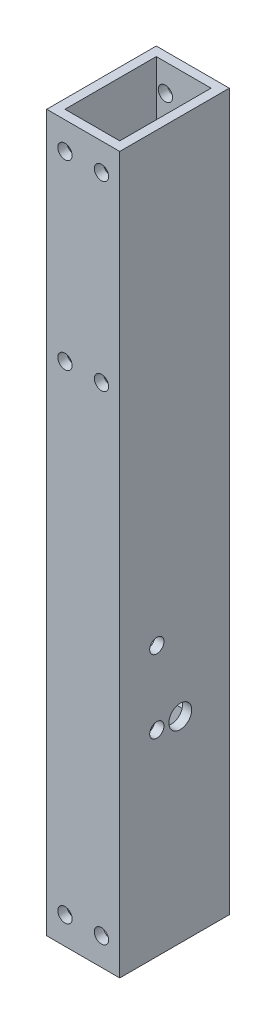
ISO-10303-21;
HEADER;
FILE_DESCRIPTION(('STEP AP214'),'2;1');
FILE_NAME('part.step','',(''),(''),'','','');
FILE_SCHEMA(('AUTOMOTIVE_DESIGN { 1 0 10303 214 1 1 1 1 }'));
ENDSEC;
DATA;
#1=APPLICATION_CONTEXT('core data for automotive mechanical design processes');
#2=APPLICATION_PROTOCOL_DEFINITION('international standard','automotive_design',2000,#1);
#3=PRODUCT_CONTEXT('',#1,'mechanical');
#4=PRODUCT('Part','Part','',(#3));
#5=PRODUCT_RELATED_PRODUCT_CATEGORY('part','',(#4));
#6=PRODUCT_DEFINITION_FORMATION('','',#4);
#7=PRODUCT_DEFINITION_CONTEXT('part definition',#1,'design');
#8=PRODUCT_DEFINITION('design','',#6,#7);
#9=PRODUCT_DEFINITION_SHAPE('','',#8);
#10=(LENGTH_UNIT() NAMED_UNIT(*) SI_UNIT(.MILLI.,.METRE.));
#11=(NAMED_UNIT(*) PLANE_ANGLE_UNIT() SI_UNIT($,.RADIAN.));
#12=(NAMED_UNIT(*) SI_UNIT($,.STERADIAN.) SOLID_ANGLE_UNIT());
#13=UNCERTAINTY_MEASURE_WITH_UNIT(LENGTH_MEASURE(1.E-05),#10,'distance_accuracy_value','');
#14=(GEOMETRIC_REPRESENTATION_CONTEXT(3) GLOBAL_UNCERTAINTY_ASSIGNED_CONTEXT((#13)) GLOBAL_UNIT_ASSIGNED_CONTEXT((#10,
#11,#12)) REPRESENTATION_CONTEXT('',''));
#15=CARTESIAN_POINT('',(0.,0.,0.));
#16=DIRECTION('',(0.,0.,1.));
#17=DIRECTION('',(1.,0.,0.));
#18=AXIS2_PLACEMENT_3D('',#15,#16,#17);
#19=CARTESIAN_POINT('',(21.082,57.1499999999999,-17.9470819172588));
#20=DIRECTION('',(0.,0.,1.));
#21=DIRECTION('',(1.,0.,0.));
#22=AXIS2_PLACEMENT_3D('',#19,#20,#21);
#23=PLANE('',#22);
#24=DIRECTION('',(0.,1.,0.));
#25=VECTOR('',#24,1.);
#26=CARTESIAN_POINT('',(0.,57.1499999999999,-17.9470819172588));
#27=LINE('',#26,#25);
#28=CARTESIAN_POINT('',(0.,57.1499999999999,-17.9470819172588));
#29=VERTEX_POINT('',#28);
#30=CARTESIAN_POINT('',(0.,65.8065865135179,-17.9470819172588));
#31=VERTEX_POINT('',#30);
#32=EDGE_CURVE('E181',#29,#31,#27,.T.);
#33=ORIENTED_EDGE('',*,*,#32,.T.);
#34=DIRECTION('',(1.,0.,0.));
#35=VECTOR('',#34,1.);
#36=CARTESIAN_POINT('',(0.,65.8065865135179,-17.9470819172588));
#37=LINE('',#36,#35);
#38=CARTESIAN_POINT('',(3.175,65.8065865135179,-17.9470819172588));
#39=VERTEX_POINT('',#38);
#40=EDGE_CURVE('E12',#31,#39,#37,.T.);
#41=ORIENTED_EDGE('',*,*,#40,.T.);
#42=DIRECTION('',(0.,-1.,0.));
#43=VECTOR('',#42,1.);
#44=CARTESIAN_POINT('',(3.175,248.92,-17.9470819172588));
#45=LINE('',#44,#43);
#46=CARTESIAN_POINT('',(3.175,57.1499999999999,-17.9470819172588));
#47=VERTEX_POINT('',#46);
#48=EDGE_CURVE('E287',#39,#47,#45,.T.);
#49=ORIENTED_EDGE('',*,*,#48,.T.);
#50=DIRECTION('',(-1.,0.,0.));
#51=VECTOR('',#50,1.);
#52=CARTESIAN_POINT('',(21.082,57.1499999999999,-17.9470819172588));
#53=LINE('',#52,#51);
#54=EDGE_CURVE('E187',#47,#29,#53,.T.);
#55=ORIENTED_EDGE('',*,*,#54,.T.);
#56=EDGE_LOOP('',(#33,#41,#49,#55));
#57=FACE_BOUND('',#56,.T.);
#58=ADVANCED_FACE('F59',(#57),#23,.F.);
#59=CARTESIAN_POINT('',(0.,248.92,0.));
#60=DIRECTION('',(0.,1.,0.));
#61=DIRECTION('',(0.,0.,1.));
#62=AXIS2_PLACEMENT_3D('',#59,#60,#61);
#63=PLANE('',#62);
#64=DIRECTION('',(0.,0.,1.));
#65=VECTOR('',#64,1.);
#66=CARTESIAN_POINT('',(0.,248.92,0.));
#67=LINE('',#66,#65);
#68=CARTESIAN_POINT('',(0.,248.92,-38.1));
#69=VERTEX_POINT('',#68);
#70=CARTESIAN_POINT('',(0.,248.92,0.));
#71=VERTEX_POINT('',#70);
#72=EDGE_CURVE('E248',#69,#71,#67,.T.);
#73=ORIENTED_EDGE('',*,*,#72,.T.);
#74=DIRECTION('',(1.,0.,0.));
#75=VECTOR('',#74,1.);
#76=CARTESIAN_POINT('',(0.,248.92,0.));
#77=LINE('',#76,#75);
#78=CARTESIAN_POINT('',(25.4,248.92,0.));
#79=VERTEX_POINT('',#78);
#80=EDGE_CURVE('E251',#71,#79,#77,.T.);
#81=ORIENTED_EDGE('',*,*,#80,.T.);
#82=DIRECTION('',(0.,0.,-1.));
#83=VECTOR('',#82,1.);
#84=CARTESIAN_POINT('',(25.4,248.92,0.));
#85=LINE('',#84,#83);
#86=CARTESIAN_POINT('',(25.4,248.92,-38.1));
#87=VERTEX_POINT('',#86);
#88=EDGE_CURVE('E254',#79,#87,#85,.T.);
#89=ORIENTED_EDGE('',*,*,#88,.T.);
#90=DIRECTION('',(-1.,0.,0.));
#91=VECTOR('',#90,1.);
#92=CARTESIAN_POINT('',(0.,248.92,-38.1));
#93=LINE('',#92,#91);
#94=EDGE_CURVE('E256',#87,#69,#93,.T.);
#95=ORIENTED_EDGE('',*,*,#94,.T.);
#96=EDGE_LOOP('',(#73,#81,#89,#95));
#97=FACE_BOUND('',#96,.T.);
#98=DIRECTION('',(1.,0.,0.));
#99=VECTOR('',#98,1.);
#100=CARTESIAN_POINT('',(0.,248.92,-3.175));
#101=LINE('',#100,#99);
#102=CARTESIAN_POINT('',(3.175,248.92,-3.175));
#103=VERTEX_POINT('',#102);
#104=CARTESIAN_POINT('',(22.225,248.92,-3.175));
#105=VERTEX_POINT('',#104);
#106=EDGE_CURVE('E218',#103,#105,#101,.T.);
#107=ORIENTED_EDGE('',*,*,#106,.F.);
#108=DIRECTION('',(0.,0.,1.));
#109=VECTOR('',#108,1.);
#110=CARTESIAN_POINT('',(3.175,248.92,0.));
#111=LINE('',#110,#109);
#112=CARTESIAN_POINT('',(3.175,248.92,-34.925));
#113=VERTEX_POINT('',#112);
#114=EDGE_CURVE('E216',#113,#103,#111,.T.);
#115=ORIENTED_EDGE('',*,*,#114,.F.);
#116=DIRECTION('',(-1.,0.,0.));
#117=VECTOR('',#116,1.);
#118=CARTESIAN_POINT('',(0.,248.92,-34.925));
#119=LINE('',#118,#117);
#120=CARTESIAN_POINT('',(22.225,248.92,-34.925));
#121=VERTEX_POINT('',#120);
#122=EDGE_CURVE('E224',#121,#113,#119,.T.);
#123=ORIENTED_EDGE('',*,*,#122,.F.);
#124=DIRECTION('',(0.,0.,-1.));
#125=VECTOR('',#124,1.);
#126=CARTESIAN_POINT('',(22.225,248.92,0.));
#127=LINE('',#126,#125);
#128=EDGE_CURVE('E221',#105,#121,#127,.T.);
#129=ORIENTED_EDGE('',*,*,#128,.F.);
#130=EDGE_LOOP('',(#107,#115,#123,#129));
#131=FACE_BOUND('',#130,.T.);
#132=ADVANCED_FACE('F434',(#97,#131),#63,.T.);
#133=CARTESIAN_POINT('',(0.,0.,0.));
#134=DIRECTION('',(0.,1.,0.));
#135=DIRECTION('',(0.,0.,1.));
#136=AXIS2_PLACEMENT_3D('',#133,#134,#135);
#137=PLANE('',#136);
#138=DIRECTION('',(0.,0.,1.));
#139=VECTOR('',#138,1.);
#140=CARTESIAN_POINT('',(0.,0.,0.));
#141=LINE('',#140,#139);
#142=CARTESIAN_POINT('',(0.,0.,-38.1));
#143=VERTEX_POINT('',#142);
#144=CARTESIAN_POINT('',(0.,0.,0.));
#145=VERTEX_POINT('',#144);
#146=EDGE_CURVE('E247',#143,#145,#141,.T.);
#147=ORIENTED_EDGE('',*,*,#146,.F.);
#148=DIRECTION('',(-1.,0.,0.));
#149=VECTOR('',#148,1.);
#150=CARTESIAN_POINT('',(0.,0.,-38.1));
#151=LINE('',#150,#149);
#152=CARTESIAN_POINT('',(25.4,0.,-38.1));
#153=VERTEX_POINT('',#152);
#154=EDGE_CURVE('E252',#153,#143,#151,.T.);
#155=ORIENTED_EDGE('',*,*,#154,.F.);
#156=DIRECTION('',(0.,0.,-1.));
#157=VECTOR('',#156,1.);
#158=CARTESIAN_POINT('',(25.4,0.,0.));
#159=LINE('',#158,#157);
#160=CARTESIAN_POINT('',(25.4,0.,0.));
#161=VERTEX_POINT('',#160);
#162=EDGE_CURVE('E263',#161,#153,#159,.T.);
#163=ORIENTED_EDGE('',*,*,#162,.F.);
#164=DIRECTION('',(1.,0.,0.));
#165=VECTOR('',#164,1.);
#166=CARTESIAN_POINT('',(0.,0.,0.));
#167=LINE('',#166,#165);
#168=EDGE_CURVE('E261',#145,#161,#167,.T.);
#169=ORIENTED_EDGE('',*,*,#168,.F.);
#170=EDGE_LOOP('',(#147,#155,#163,#169));
#171=FACE_BOUND('',#170,.T.);
#172=DIRECTION('',(0.,0.,1.));
#173=VECTOR('',#172,1.);
#174=CARTESIAN_POINT('',(3.175,0.,0.));
#175=LINE('',#174,#173);
#176=CARTESIAN_POINT('',(3.175,0.,-34.925));
#177=VERTEX_POINT('',#176);
#178=CARTESIAN_POINT('',(3.175,0.,-3.175));
#179=VERTEX_POINT('',#178);
#180=EDGE_CURVE('E215',#177,#179,#175,.T.);
#181=ORIENTED_EDGE('',*,*,#180,.T.);
#182=DIRECTION('',(1.,0.,0.));
#183=VECTOR('',#182,1.);
#184=CARTESIAN_POINT('',(0.,0.,-3.175));
#185=LINE('',#184,#183);
#186=CARTESIAN_POINT('',(22.225,0.,-3.175));
#187=VERTEX_POINT('',#186);
#188=EDGE_CURVE('E229',#179,#187,#185,.T.);
#189=ORIENTED_EDGE('',*,*,#188,.T.);
#190=DIRECTION('',(0.,0.,-1.));
#191=VECTOR('',#190,1.);
#192=CARTESIAN_POINT('',(22.225,0.,0.));
#193=LINE('',#192,#191);
#194=CARTESIAN_POINT('',(22.225,0.,-34.925));
#195=VERTEX_POINT('',#194);
#196=EDGE_CURVE('E232',#187,#195,#193,.T.);
#197=ORIENTED_EDGE('',*,*,#196,.T.);
#198=DIRECTION('',(-1.,0.,0.));
#199=VECTOR('',#198,1.);
#200=CARTESIAN_POINT('',(0.,0.,-34.925));
#201=LINE('',#200,#199);
#202=EDGE_CURVE('E219',#195,#177,#201,.T.);
#203=ORIENTED_EDGE('',*,*,#202,.T.);
#204=EDGE_LOOP('',(#181,#189,#197,#203));
#205=FACE_BOUND('',#204,.T.);
#206=ADVANCED_FACE('F427',(#171,#205),#137,.F.);
#207=CARTESIAN_POINT('',(0.,248.92,0.));
#208=DIRECTION('',(1.,0.,0.));
#209=DIRECTION('',(0.,0.,-1.));
#210=AXIS2_PLACEMENT_3D('',#207,#208,#209);
#211=PLANE('',#210);
#212=CARTESIAN_POINT('',(0.,68.2624999999999,-12.9032000000046));
#213=DIRECTION('',(-1.,0.,0.));
#214=DIRECTION('',(0.,0.,1.));
#215=AXIS2_PLACEMENT_3D('',#212,#213,#214);
#216=CIRCLE('',#215,2.4892);
#217=CARTESIAN_POINT('',(0.,68.2624999999999,-10.4140000000046));
#218=VERTEX_POINT('',#217);
#219=EDGE_CURVE('E377',#218,#218,#216,.T.);
#220=ORIENTED_EDGE('',*,*,#219,.F.);
#221=EDGE_LOOP('',(#220));
#222=FACE_BOUND('',#221,.T.);
#223=CARTESIAN_POINT('',(0.,93.6624999999999,-12.903200000003));
#224=DIRECTION('',(-1.,0.,0.));
#225=DIRECTION('',(0.,0.,1.));
#226=AXIS2_PLACEMENT_3D('',#223,#224,#225);
#227=CIRCLE('',#226,2.48919999999999);
#228=CARTESIAN_POINT('',(0.,93.6624999999999,-10.414000000003));
#229=VERTEX_POINT('',#228);
#230=EDGE_CURVE('E386',#229,#229,#227,.T.);
#231=ORIENTED_EDGE('',*,*,#230,.F.);
#232=EDGE_LOOP('',(#231));
#233=FACE_BOUND('',#232,.T.);
#234=CARTESIAN_POINT('',(0.,70.7184134864701,-17.9470819172588));
#235=VERTEX_POINT('',#234);
#236=CARTESIAN_POINT('',(0.,79.375,-17.9470819172588));
#237=VERTEX_POINT('',#236);
#238=EDGE_CURVE('E183',#235,#237,#27,.T.);
#239=ORIENTED_EDGE('',*,*,#238,.F.);
#240=CARTESIAN_POINT('',(0.,68.262499999994,-21.0566000000072));
#241=DIRECTION('',(1.,0.,0.));
#242=DIRECTION('',(0.,1.,0.));
#243=AXIS2_PLACEMENT_3D('',#240,#241,#242);
#244=CIRCLE('',#243,3.9623999999993);
#245=EDGE_CURVE('E76',#235,#31,#244,.T.);
#246=ORIENTED_EDGE('',*,*,#245,.T.);
#247=ORIENTED_EDGE('',*,*,#32,.F.);
#248=DIRECTION('',(0.,0.,1.));
#249=VECTOR('',#248,1.);
#250=CARTESIAN_POINT('',(0.,57.1499999999999,-17.9470819172588));
#251=LINE('',#250,#249);
#252=CARTESIAN_POINT('',(0.,57.1499999999999,-38.1));
#253=VERTEX_POINT('',#252);
#254=EDGE_CURVE('E191',#253,#29,#251,.T.);
#255=ORIENTED_EDGE('',*,*,#254,.F.);
#256=DIRECTION('',(0.,-1.,0.));
#257=VECTOR('',#256,1.);
#258=CARTESIAN_POINT('',(0.,248.92,-38.1));
#259=LINE('',#258,#257);
#260=EDGE_CURVE('E258',#253,#143,#259,.T.);
#261=ORIENTED_EDGE('',*,*,#260,.T.);
#262=ORIENTED_EDGE('',*,*,#146,.T.);
#263=DIRECTION('',(0.,-1.,0.));
#264=VECTOR('',#263,1.);
#265=CARTESIAN_POINT('',(0.,248.92,0.));
#266=LINE('',#265,#264);
#267=EDGE_CURVE('E276',#71,#145,#266,.T.);
#268=ORIENTED_EDGE('',*,*,#267,.F.);
#269=ORIENTED_EDGE('',*,*,#72,.F.);
#270=CARTESIAN_POINT('',(0.,79.375,-38.1));
#271=VERTEX_POINT('',#270);
#272=EDGE_CURVE('E267',#69,#271,#259,.T.);
#273=ORIENTED_EDGE('',*,*,#272,.T.);
#274=DIRECTION('',(0.,0.,-1.));
#275=VECTOR('',#274,1.);
#276=CARTESIAN_POINT('',(0.,79.375,-17.9470819172588));
#277=LINE('',#276,#275);
#278=EDGE_CURVE('E189',#237,#271,#277,.T.);
#279=ORIENTED_EDGE('',*,*,#278,.F.);
#280=EDGE_LOOP('',(#239,#246,#247,#255,#261,#262,#268,#269,#273,#279));
#281=FACE_BOUND('',#280,.T.);
#282=ADVANCED_FACE('F61',(#222,#233,#281),#211,.F.);
#283=CARTESIAN_POINT('',(0.,248.92,0.));
#284=DIRECTION('',(0.,0.,-1.));
#285=DIRECTION('',(-1.,0.,0.));
#286=AXIS2_PLACEMENT_3D('',#283,#284,#285);
#287=PLANE('',#286);
#288=CARTESIAN_POINT('',(19.0500000000001,176.154649999993,0.));
#289=DIRECTION('',(0.,0.,-1.));
#290=DIRECTION('',(-1.,0.,0.));
#291=AXIS2_PLACEMENT_3D('',#288,#289,#290);
#292=CIRCLE('',#291,2.48920000000288);
#293=CARTESIAN_POINT('',(16.5607999999972,176.154649999993,0.));
#294=VERTEX_POINT('',#293);
#295=EDGE_CURVE('E319',#294,#294,#292,.T.);
#296=ORIENTED_EDGE('',*,*,#295,.T.);
#297=EDGE_LOOP('',(#296));
#298=FACE_BOUND('',#297,.T.);
#299=CARTESIAN_POINT('',(6.35000000000008,176.154649999993,0.));
#300=DIRECTION('',(0.,0.,-1.));
#301=DIRECTION('',(-1.,0.,0.));
#302=AXIS2_PLACEMENT_3D('',#299,#300,#301);
#303=CIRCLE('',#302,2.48920000000288);
#304=CARTESIAN_POINT('',(3.86079999999719,176.154649999993,0.));
#305=VERTEX_POINT('',#304);
#306=EDGE_CURVE('E330',#305,#305,#303,.T.);
#307=ORIENTED_EDGE('',*,*,#306,.T.);
#308=EDGE_LOOP('',(#307));
#309=FACE_BOUND('',#308,.T.);
#310=CARTESIAN_POINT('',(19.05,239.395,0.));
#311=DIRECTION('',(0.,0.,-1.));
#312=DIRECTION('',(-1.,0.,0.));
#313=AXIS2_PLACEMENT_3D('',#310,#311,#312);
#314=CIRCLE('',#313,2.48920000000013);
#315=CARTESIAN_POINT('',(16.5607999999999,239.395,0.));
#316=VERTEX_POINT('',#315);
#317=EDGE_CURVE('E355',#316,#316,#314,.T.);
#318=ORIENTED_EDGE('',*,*,#317,.T.);
#319=EDGE_LOOP('',(#318));
#320=FACE_BOUND('',#319,.T.);
#321=CARTESIAN_POINT('',(6.34999999999999,239.395,0.));
#322=DIRECTION('',(0.,0.,-1.));
#323=DIRECTION('',(-1.,0.,0.));
#324=AXIS2_PLACEMENT_3D('',#321,#322,#323);
#325=CIRCLE('',#324,2.48920000000011);
#326=CARTESIAN_POINT('',(3.86079999999989,239.395,0.));
#327=VERTEX_POINT('',#326);
#328=EDGE_CURVE('E349',#327,#327,#325,.T.);
#329=ORIENTED_EDGE('',*,*,#328,.T.);
#330=EDGE_LOOP('',(#329));
#331=FACE_BOUND('',#330,.T.);
#332=CARTESIAN_POINT('',(6.35000000000032,9.52500000000017,0.));
#333=DIRECTION('',(0.,0.,-1.));
#334=DIRECTION('',(-1.,0.,0.));
#335=AXIS2_PLACEMENT_3D('',#332,#333,#334);
#336=CIRCLE('',#335,2.4892);
#337=CARTESIAN_POINT('',(3.86080000000032,9.52500000000017,0.));
#338=VERTEX_POINT('',#337);
#339=EDGE_CURVE('E342',#338,#338,#336,.T.);
#340=ORIENTED_EDGE('',*,*,#339,.T.);
#341=EDGE_LOOP('',(#340));
#342=FACE_BOUND('',#341,.T.);
#343=CARTESIAN_POINT('',(19.0500000000003,9.52500000000002,0.));
#344=DIRECTION('',(0.,0.,-1.));
#345=DIRECTION('',(-1.,0.,0.));
#346=AXIS2_PLACEMENT_3D('',#343,#344,#345);
#347=CIRCLE('',#346,2.4892);
#348=CARTESIAN_POINT('',(16.5608000000003,9.52500000000002,0.));
#349=VERTEX_POINT('',#348);
#350=EDGE_CURVE('E305',#349,#349,#347,.T.);
#351=ORIENTED_EDGE('',*,*,#350,.T.);
#352=EDGE_LOOP('',(#351));
#353=FACE_BOUND('',#352,.T.);
#354=ORIENTED_EDGE('',*,*,#168,.T.);
#355=DIRECTION('',(0.,-1.,0.));
#356=VECTOR('',#355,1.);
#357=CARTESIAN_POINT('',(25.4,248.92,0.));
#358=LINE('',#357,#356);
#359=EDGE_CURVE('E273',#79,#161,#358,.T.);
#360=ORIENTED_EDGE('',*,*,#359,.F.);
#361=ORIENTED_EDGE('',*,*,#80,.F.);
#362=ORIENTED_EDGE('',*,*,#267,.T.);
#363=EDGE_LOOP('',(#354,#360,#361,#362));
#364=FACE_BOUND('',#363,.T.);
#365=ADVANCED_FACE('F431',(#298,#309,#320,#331,#342,#353,#364),#287,.F.);
#366=CARTESIAN_POINT('',(25.4,248.92,0.));
#367=DIRECTION('',(-1.,0.,0.));
#368=DIRECTION('',(0.,0.,1.));
#369=AXIS2_PLACEMENT_3D('',#366,#367,#368);
#370=PLANE('',#369);
#371=CARTESIAN_POINT('',(25.4,68.262499999994,-21.056600000008));
#372=DIRECTION('',(1.,0.,0.));
#373=DIRECTION('',(0.,0.,-1.));
#374=AXIS2_PLACEMENT_3D('',#371,#372,#373);
#375=CIRCLE('',#374,3.96239999999845);
#376=CARTESIAN_POINT('',(25.4,68.262499999994,-25.0190000000065));
#377=VERTEX_POINT('',#376);
#378=EDGE_CURVE('E373',#377,#377,#375,.T.);
#379=ORIENTED_EDGE('',*,*,#378,.F.);
#380=EDGE_LOOP('',(#379));
#381=FACE_BOUND('',#380,.T.);
#382=CARTESIAN_POINT('',(25.4,68.2624999999999,-12.9032000000046));
#383=DIRECTION('',(-1.,0.,0.));
#384=DIRECTION('',(0.,0.,1.));
#385=AXIS2_PLACEMENT_3D('',#382,#383,#384);
#386=CIRCLE('',#385,2.4892);
#387=CARTESIAN_POINT('',(25.4,68.2624999999999,-10.4140000000046));
#388=VERTEX_POINT('',#387);
#389=EDGE_CURVE('E299',#388,#388,#386,.T.);
#390=ORIENTED_EDGE('',*,*,#389,.T.);
#391=EDGE_LOOP('',(#390));
#392=FACE_BOUND('',#391,.T.);
#393=CARTESIAN_POINT('',(25.4,93.6624999999999,-12.903200000003));
#394=DIRECTION('',(-1.,0.,0.));
#395=DIRECTION('',(0.,0.,1.));
#396=AXIS2_PLACEMENT_3D('',#393,#394,#395);
#397=CIRCLE('',#396,2.48919999999999);
#398=CARTESIAN_POINT('',(25.4,93.6624999999999,-10.414000000003));
#399=VERTEX_POINT('',#398);
#400=EDGE_CURVE('E294',#399,#399,#397,.T.);
#401=ORIENTED_EDGE('',*,*,#400,.T.);
#402=EDGE_LOOP('',(#401));
#403=FACE_BOUND('',#402,.T.);
#404=ORIENTED_EDGE('',*,*,#162,.T.);
#405=DIRECTION('',(0.,-1.,0.));
#406=VECTOR('',#405,1.);
#407=CARTESIAN_POINT('',(25.4,248.92,-38.1));
#408=LINE('',#407,#406);
#409=EDGE_CURVE('E270',#87,#153,#408,.T.);
#410=ORIENTED_EDGE('',*,*,#409,.F.);
#411=ORIENTED_EDGE('',*,*,#88,.F.);
#412=ORIENTED_EDGE('',*,*,#359,.T.);
#413=EDGE_LOOP('',(#404,#410,#411,#412));
#414=FACE_BOUND('',#413,.T.);
#415=ADVANCED_FACE('F437',(#381,#392,#403,#414),#370,.F.);
#416=CARTESIAN_POINT('',(0.,248.92,-38.1));
#417=DIRECTION('',(0.,0.,1.));
#418=DIRECTION('',(1.,0.,0.));
#419=AXIS2_PLACEMENT_3D('',#416,#417,#418);
#420=PLANE('',#419);
#421=CARTESIAN_POINT('',(19.0500000000001,176.154649999993,-38.1));
#422=DIRECTION('',(0.,0.,-1.));
#423=DIRECTION('',(-1.,0.,0.));
#424=AXIS2_PLACEMENT_3D('',#421,#422,#423);
#425=CIRCLE('',#424,2.48920000000288);
#426=CARTESIAN_POINT('',(16.5607999999972,176.154649999993,-38.1));
#427=VERTEX_POINT('',#426);
#428=EDGE_CURVE('E325',#427,#427,#425,.T.);
#429=ORIENTED_EDGE('',*,*,#428,.F.);
#430=EDGE_LOOP('',(#429));
#431=FACE_BOUND('',#430,.T.);
#432=CARTESIAN_POINT('',(6.35000000000008,176.154649999993,-38.1));
#433=DIRECTION('',(0.,0.,-1.));
#434=DIRECTION('',(-1.,0.,0.));
#435=AXIS2_PLACEMENT_3D('',#432,#433,#434);
#436=CIRCLE('',#435,2.48920000000288);
#437=CARTESIAN_POINT('',(3.86079999999719,176.154649999993,-38.1));
#438=VERTEX_POINT('',#437);
#439=EDGE_CURVE('E335',#438,#438,#436,.T.);
#440=ORIENTED_EDGE('',*,*,#439,.F.);
#441=EDGE_LOOP('',(#440));
#442=FACE_BOUND('',#441,.T.);
#443=CARTESIAN_POINT('',(19.05,239.395,-38.1));
#444=DIRECTION('',(0.,0.,-1.));
#445=DIRECTION('',(-1.,0.,0.));
#446=AXIS2_PLACEMENT_3D('',#443,#444,#445);
#447=CIRCLE('',#446,2.48920000000013);
#448=CARTESIAN_POINT('',(16.5607999999999,239.395,-38.1));
#449=VERTEX_POINT('',#448);
#450=EDGE_CURVE('E341',#449,#449,#447,.T.);
#451=ORIENTED_EDGE('',*,*,#450,.F.);
#452=EDGE_LOOP('',(#451));
#453=FACE_BOUND('',#452,.T.);
#454=CARTESIAN_POINT('',(6.34999999999999,239.395,-38.1));
#455=DIRECTION('',(0.,0.,-1.));
#456=DIRECTION('',(-1.,0.,0.));
#457=AXIS2_PLACEMENT_3D('',#454,#455,#456);
#458=CIRCLE('',#457,2.48920000000011);
#459=CARTESIAN_POINT('',(3.86079999999989,239.395,-38.1));
#460=VERTEX_POINT('',#459);
#461=EDGE_CURVE('E352',#460,#460,#458,.T.);
#462=ORIENTED_EDGE('',*,*,#461,.F.);
#463=EDGE_LOOP('',(#462));
#464=FACE_BOUND('',#463,.T.);
#465=CARTESIAN_POINT('',(6.35000000000032,9.52500000000017,-38.1));
#466=DIRECTION('',(0.,0.,-1.));
#467=DIRECTION('',(-1.,0.,0.));
#468=AXIS2_PLACEMENT_3D('',#465,#466,#467);
#469=CIRCLE('',#468,2.4892);
#470=CARTESIAN_POINT('',(3.86080000000032,9.52500000000017,-38.1));
#471=VERTEX_POINT('',#470);
#472=EDGE_CURVE('E346',#471,#471,#469,.T.);
#473=ORIENTED_EDGE('',*,*,#472,.F.);
#474=EDGE_LOOP('',(#473));
#475=FACE_BOUND('',#474,.T.);
#476=CARTESIAN_POINT('',(19.0500000000003,9.52500000000002,-38.1));
#477=DIRECTION('',(0.,0.,-1.));
#478=DIRECTION('',(-1.,0.,0.));
#479=AXIS2_PLACEMENT_3D('',#476,#477,#478);
#480=CIRCLE('',#479,2.4892);
#481=CARTESIAN_POINT('',(16.5608000000003,9.52500000000002,-38.1));
#482=VERTEX_POINT('',#481);
#483=EDGE_CURVE('E345',#482,#482,#480,.T.);
#484=ORIENTED_EDGE('',*,*,#483,.F.);
#485=EDGE_LOOP('',(#484));
#486=FACE_BOUND('',#485,.T.);
#487=ORIENTED_EDGE('',*,*,#260,.F.);
#488=DIRECTION('',(1.,0.,0.));
#489=VECTOR('',#488,1.);
#490=CARTESIAN_POINT('',(0.,57.1499999999999,-38.1));
#491=LINE('',#490,#489);
#492=CARTESIAN_POINT('',(21.082,57.1499999999999,-38.1));
#493=VERTEX_POINT('',#492);
#494=EDGE_CURVE('E212',#253,#493,#491,.T.);
#495=ORIENTED_EDGE('',*,*,#494,.T.);
#496=DIRECTION('',(0.,-1.,0.));
#497=VECTOR('',#496,1.);
#498=CARTESIAN_POINT('',(21.082,248.92,-38.1));
#499=LINE('',#498,#497);
#500=CARTESIAN_POINT('',(21.082,79.375,-38.1));
#501=VERTEX_POINT('',#500);
#502=EDGE_CURVE('E200',#501,#493,#499,.T.);
#503=ORIENTED_EDGE('',*,*,#502,.F.);
#504=DIRECTION('',(-1.,0.,0.));
#505=VECTOR('',#504,1.);
#506=CARTESIAN_POINT('',(0.,79.3749999999999,-38.1));
#507=LINE('',#506,#505);
#508=EDGE_CURVE('E207',#501,#271,#507,.T.);
#509=ORIENTED_EDGE('',*,*,#508,.T.);
#510=ORIENTED_EDGE('',*,*,#272,.F.);
#511=ORIENTED_EDGE('',*,*,#94,.F.);
#512=ORIENTED_EDGE('',*,*,#409,.T.);
#513=ORIENTED_EDGE('',*,*,#154,.T.);
#514=EDGE_LOOP('',(#487,#495,#503,#509,#510,#511,#512,#513));
#515=FACE_BOUND('',#514,.T.);
#516=ADVANCED_FACE('F421',(#431,#442,#453,#464,#475,#486,#515),#420,.F.);
#517=CARTESIAN_POINT('',(3.175,248.92,0.));
#518=DIRECTION('',(1.,0.,0.));
#519=DIRECTION('',(0.,0.,-1.));
#520=AXIS2_PLACEMENT_3D('',#517,#518,#519);
#521=PLANE('',#520);
#522=CARTESIAN_POINT('',(3.175,68.262499999994,-21.0566000000072));
#523=DIRECTION('',(1.,0.,0.));
#524=DIRECTION('',(0.,0.,-1.));
#525=AXIS2_PLACEMENT_3D('',#522,#523,#524);
#526=CIRCLE('',#525,3.9623999999993);
#527=CARTESIAN_POINT('',(3.175,70.7184134864701,-17.9470819172588));
#528=VERTEX_POINT('',#527);
#529=EDGE_CURVE('E173',#528,#39,#526,.T.);
#530=ORIENTED_EDGE('',*,*,#529,.F.);
#531=CARTESIAN_POINT('',(3.175,79.375,-17.9470819172588));
#532=VERTEX_POINT('',#531);
#533=EDGE_CURVE('E288',#532,#528,#45,.T.);
#534=ORIENTED_EDGE('',*,*,#533,.F.);
#535=DIRECTION('',(0.,0.,1.));
#536=VECTOR('',#535,1.);
#537=CARTESIAN_POINT('',(3.175,79.3749999999999,0.));
#538=LINE('',#537,#536);
#539=CARTESIAN_POINT('',(3.175,79.3749999999999,-34.925));
#540=VERTEX_POINT('',#539);
#541=EDGE_CURVE('E205',#540,#532,#538,.T.);
#542=ORIENTED_EDGE('',*,*,#541,.F.);
#543=DIRECTION('',(0.,-1.,0.));
#544=VECTOR('',#543,1.);
#545=CARTESIAN_POINT('',(3.175,248.92,-34.925));
#546=LINE('',#545,#544);
#547=EDGE_CURVE('E237',#113,#540,#546,.T.);
#548=ORIENTED_EDGE('',*,*,#547,.F.);
#549=ORIENTED_EDGE('',*,*,#114,.T.);
#550=DIRECTION('',(0.,-1.,0.));
#551=VECTOR('',#550,1.);
#552=CARTESIAN_POINT('',(3.175,248.92,-3.175));
#553=LINE('',#552,#551);
#554=EDGE_CURVE('E244',#103,#179,#553,.T.);
#555=ORIENTED_EDGE('',*,*,#554,.T.);
#556=ORIENTED_EDGE('',*,*,#180,.F.);
#557=CARTESIAN_POINT('',(3.175,57.1499999999999,-34.925));
#558=VERTEX_POINT('',#557);
#559=EDGE_CURVE('E226',#558,#177,#546,.T.);
#560=ORIENTED_EDGE('',*,*,#559,.F.);
#561=DIRECTION('',(0.,0.,-1.));
#562=VECTOR('',#561,1.);
#563=CARTESIAN_POINT('',(3.175,57.1499999999999,0.));
#564=LINE('',#563,#562);
#565=EDGE_CURVE('E210',#47,#558,#564,.T.);
#566=ORIENTED_EDGE('',*,*,#565,.F.);
#567=ORIENTED_EDGE('',*,*,#48,.F.);
#568=EDGE_LOOP('',(#530,#534,#542,#548,#549,#555,#556,#560,#566,#567));
#569=FACE_BOUND('',#568,.T.);
#570=CARTESIAN_POINT('',(3.175,68.2624999999999,-12.9032000000046));
#571=DIRECTION('',(1.,0.,0.));
#572=DIRECTION('',(0.,0.,-1.));
#573=AXIS2_PLACEMENT_3D('',#570,#571,#572);
#574=CIRCLE('',#573,2.4892);
#575=CARTESIAN_POINT('',(3.175,68.2624999999999,-15.3924000000046));
#576=VERTEX_POINT('',#575);
#577=EDGE_CURVE('E298',#576,#576,#574,.T.);
#578=ORIENTED_EDGE('',*,*,#577,.F.);
#579=EDGE_LOOP('',(#578));
#580=FACE_BOUND('',#579,.T.);
#581=CARTESIAN_POINT('',(3.175,93.6624999999999,-12.903200000003));
#582=DIRECTION('',(1.,0.,0.));
#583=DIRECTION('',(0.,0.,-1.));
#584=AXIS2_PLACEMENT_3D('',#581,#582,#583);
#585=CIRCLE('',#584,2.48919999999999);
#586=CARTESIAN_POINT('',(3.175,93.6624999999999,-15.392400000003));
#587=VERTEX_POINT('',#586);
#588=EDGE_CURVE('E193',#587,#587,#585,.T.);
#589=ORIENTED_EDGE('',*,*,#588,.F.);
#590=EDGE_LOOP('',(#589));
#591=FACE_BOUND('',#590,.T.);
#592=ADVANCED_FACE('F410',(#569,#580,#591),#521,.T.);
#593=CARTESIAN_POINT('',(0.,248.92,-3.175));
#594=DIRECTION('',(0.,0.,-1.));
#595=DIRECTION('',(-1.,0.,0.));
#596=AXIS2_PLACEMENT_3D('',#593,#594,#595);
#597=PLANE('',#596);
#598=CARTESIAN_POINT('',(19.0500000000001,176.154649999993,-3.175));
#599=DIRECTION('',(0.,0.,-1.));
#600=DIRECTION('',(-1.,0.,0.));
#601=AXIS2_PLACEMENT_3D('',#598,#599,#600);
#602=CIRCLE('',#601,2.48920000000288);
#603=CARTESIAN_POINT('',(16.5607999999972,176.154649999993,-3.175));
#604=VERTEX_POINT('',#603);
#605=EDGE_CURVE('E338',#604,#604,#602,.T.);
#606=ORIENTED_EDGE('',*,*,#605,.F.);
#607=EDGE_LOOP('',(#606));
#608=FACE_BOUND('',#607,.T.);
#609=CARTESIAN_POINT('',(6.35000000000008,176.154649999993,-3.175));
#610=DIRECTION('',(0.,0.,-1.));
#611=DIRECTION('',(-1.,0.,0.));
#612=AXIS2_PLACEMENT_3D('',#609,#610,#611);
#613=CIRCLE('',#612,2.48920000000288);
#614=CARTESIAN_POINT('',(3.86079999999719,176.154649999993,-3.175));
#615=VERTEX_POINT('',#614);
#616=EDGE_CURVE('E318',#615,#615,#613,.T.);
#617=ORIENTED_EDGE('',*,*,#616,.F.);
#618=EDGE_LOOP('',(#617));
#619=FACE_BOUND('',#618,.T.);
#620=CARTESIAN_POINT('',(19.05,239.395,-3.175));
#621=DIRECTION('',(0.,0.,-1.));
#622=DIRECTION('',(-1.,0.,0.));
#623=AXIS2_PLACEMENT_3D('',#620,#621,#622);
#624=CIRCLE('',#623,2.48920000000013);
#625=CARTESIAN_POINT('',(16.5607999999999,239.395,-3.175));
#626=VERTEX_POINT('',#625);
#627=EDGE_CURVE('E184',#626,#626,#624,.T.);
#628=ORIENTED_EDGE('',*,*,#627,.F.);
#629=EDGE_LOOP('',(#628));
#630=FACE_BOUND('',#629,.T.);
#631=CARTESIAN_POINT('',(6.34999999999999,239.395,-3.175));
#632=DIRECTION('',(0.,0.,-1.));
#633=DIRECTION('',(-1.,0.,0.));
#634=AXIS2_PLACEMENT_3D('',#631,#632,#633);
#635=CIRCLE('',#634,2.48920000000011);
#636=CARTESIAN_POINT('',(3.86079999999989,239.395,-3.175));
#637=VERTEX_POINT('',#636);
#638=EDGE_CURVE('E313',#637,#637,#635,.T.);
#639=ORIENTED_EDGE('',*,*,#638,.F.);
#640=EDGE_LOOP('',(#639));
#641=FACE_BOUND('',#640,.T.);
#642=CARTESIAN_POINT('',(6.35000000000032,9.52500000000017,-3.175));
#643=DIRECTION('',(0.,0.,-1.));
#644=DIRECTION('',(-1.,0.,0.));
#645=AXIS2_PLACEMENT_3D('',#642,#643,#644);
#646=CIRCLE('',#645,2.4892);
#647=CARTESIAN_POINT('',(3.86080000000032,9.52500000000017,-3.175));
#648=VERTEX_POINT('',#647);
#649=EDGE_CURVE('E309',#648,#648,#646,.T.);
#650=ORIENTED_EDGE('',*,*,#649,.F.);
#651=EDGE_LOOP('',(#650));
#652=FACE_BOUND('',#651,.T.);
#653=CARTESIAN_POINT('',(19.0500000000003,9.52500000000002,-3.175));
#654=DIRECTION('',(0.,0.,-1.));
#655=DIRECTION('',(-1.,0.,0.));
#656=AXIS2_PLACEMENT_3D('',#653,#654,#655);
#657=CIRCLE('',#656,2.4892);
#658=CARTESIAN_POINT('',(16.5608000000003,9.52500000000002,-3.175));
#659=VERTEX_POINT('',#658);
#660=EDGE_CURVE('E304',#659,#659,#657,.T.);
#661=ORIENTED_EDGE('',*,*,#660,.F.);
#662=EDGE_LOOP('',(#661));
#663=FACE_BOUND('',#662,.T.);
#664=ORIENTED_EDGE('',*,*,#188,.F.);
#665=ORIENTED_EDGE('',*,*,#554,.F.);
#666=ORIENTED_EDGE('',*,*,#106,.T.);
#667=DIRECTION('',(0.,-1.,0.));
#668=VECTOR('',#667,1.);
#669=CARTESIAN_POINT('',(22.225,248.92,-3.175));
#670=LINE('',#669,#668);
#671=EDGE_CURVE('E242',#105,#187,#670,.T.);
#672=ORIENTED_EDGE('',*,*,#671,.T.);
#673=EDGE_LOOP('',(#664,#665,#666,#672));
#674=FACE_BOUND('',#673,.T.);
#675=ADVANCED_FACE('F481',(#608,#619,#630,#641,#652,#663,#674),#597,.T.);
#676=CARTESIAN_POINT('',(22.225,248.92,0.));
#677=DIRECTION('',(-1.,0.,0.));
#678=DIRECTION('',(0.,0.,1.));
#679=AXIS2_PLACEMENT_3D('',#676,#677,#678);
#680=PLANE('',#679);
#681=CARTESIAN_POINT('',(22.225,68.262499999994,-21.056600000008));
#682=DIRECTION('',(1.,0.,0.));
#683=DIRECTION('',(0.,0.,-1.));
#684=AXIS2_PLACEMENT_3D('',#681,#682,#683);
#685=CIRCLE('',#684,3.96239999999845);
#686=CARTESIAN_POINT('',(22.225,68.262499999994,-25.0190000000065));
#687=VERTEX_POINT('',#686);
#688=EDGE_CURVE('E374',#687,#687,#685,.T.);
#689=ORIENTED_EDGE('',*,*,#688,.T.);
#690=EDGE_LOOP('',(#689));
#691=FACE_BOUND('',#690,.T.);
#692=CARTESIAN_POINT('',(22.225,68.2624999999999,-12.9032000000046));
#693=DIRECTION('',(-1.,0.,0.));
#694=DIRECTION('',(0.,0.,1.));
#695=AXIS2_PLACEMENT_3D('',#692,#693,#694);
#696=CIRCLE('',#695,2.4892);
#697=CARTESIAN_POINT('',(22.225,68.2624999999999,-10.4140000000046));
#698=VERTEX_POINT('',#697);
#699=EDGE_CURVE('E295',#698,#698,#696,.T.);
#700=ORIENTED_EDGE('',*,*,#699,.F.);
#701=EDGE_LOOP('',(#700));
#702=FACE_BOUND('',#701,.T.);
#703=CARTESIAN_POINT('',(22.225,93.6624999999999,-12.903200000003));
#704=DIRECTION('',(-1.,0.,0.));
#705=DIRECTION('',(0.,0.,1.));
#706=AXIS2_PLACEMENT_3D('',#703,#704,#705);
#707=CIRCLE('',#706,2.48919999999999);
#708=CARTESIAN_POINT('',(22.225,93.6624999999999,-10.414000000003));
#709=VERTEX_POINT('',#708);
#710=EDGE_CURVE('E291',#709,#709,#707,.T.);
#711=ORIENTED_EDGE('',*,*,#710,.F.);
#712=EDGE_LOOP('',(#711));
#713=FACE_BOUND('',#712,.T.);
#714=ORIENTED_EDGE('',*,*,#196,.F.);
#715=ORIENTED_EDGE('',*,*,#671,.F.);
#716=ORIENTED_EDGE('',*,*,#128,.T.);
#717=DIRECTION('',(0.,-1.,0.));
#718=VECTOR('',#717,1.);
#719=CARTESIAN_POINT('',(22.225,248.92,-34.925));
#720=LINE('',#719,#718);
#721=EDGE_CURVE('E240',#121,#195,#720,.T.);
#722=ORIENTED_EDGE('',*,*,#721,.T.);
#723=EDGE_LOOP('',(#714,#715,#716,#722));
#724=FACE_BOUND('',#723,.T.);
#725=ADVANCED_FACE('F476',(#691,#702,#713,#724),#680,.T.);
#726=CARTESIAN_POINT('',(0.,248.92,-34.925));
#727=DIRECTION('',(0.,0.,1.));
#728=DIRECTION('',(1.,0.,0.));
#729=AXIS2_PLACEMENT_3D('',#726,#727,#728);
#730=PLANE('',#729);
#731=CARTESIAN_POINT('',(19.0500000000001,176.154649999993,-34.925));
#732=DIRECTION('',(0.,0.,1.));
#733=DIRECTION('',(1.,0.,0.));
#734=AXIS2_PLACEMENT_3D('',#731,#732,#733);
#735=CIRCLE('',#734,2.48920000000288);
#736=CARTESIAN_POINT('',(21.539200000003,176.154649999993,-34.925));
#737=VERTEX_POINT('',#736);
#738=EDGE_CURVE('E63',#737,#737,#735,.T.);
#739=ORIENTED_EDGE('',*,*,#738,.F.);
#740=EDGE_LOOP('',(#739));
#741=FACE_BOUND('',#740,.T.);
#742=CARTESIAN_POINT('',(6.35000000000008,176.154649999993,-34.925));
#743=DIRECTION('',(0.,0.,1.));
#744=DIRECTION('',(1.,0.,0.));
#745=AXIS2_PLACEMENT_3D('',#742,#743,#744);
#746=CIRCLE('',#745,2.48920000000288);
#747=CARTESIAN_POINT('',(8.83920000000296,176.154649999993,-34.925));
#748=VERTEX_POINT('',#747);
#749=EDGE_CURVE('E316',#748,#748,#746,.T.);
#750=ORIENTED_EDGE('',*,*,#749,.F.);
#751=EDGE_LOOP('',(#750));
#752=FACE_BOUND('',#751,.T.);
#753=CARTESIAN_POINT('',(19.05,239.395,-34.925));
#754=DIRECTION('',(0.,0.,1.));
#755=DIRECTION('',(1.,0.,0.));
#756=AXIS2_PLACEMENT_3D('',#753,#754,#755);
#757=CIRCLE('',#756,2.48920000000013);
#758=CARTESIAN_POINT('',(21.5392000000001,239.395,-34.925));
#759=VERTEX_POINT('',#758);
#760=EDGE_CURVE('E314',#759,#759,#757,.T.);
#761=ORIENTED_EDGE('',*,*,#760,.F.);
#762=EDGE_LOOP('',(#761));
#763=FACE_BOUND('',#762,.T.);
#764=CARTESIAN_POINT('',(6.34999999999999,239.395,-34.925));
#765=DIRECTION('',(0.,0.,1.));
#766=DIRECTION('',(1.,0.,0.));
#767=AXIS2_PLACEMENT_3D('',#764,#765,#766);
#768=CIRCLE('',#767,2.48920000000011);
#769=CARTESIAN_POINT('',(8.8392000000001,239.395,-34.925));
#770=VERTEX_POINT('',#769);
#771=EDGE_CURVE('E310',#770,#770,#768,.T.);
#772=ORIENTED_EDGE('',*,*,#771,.F.);
#773=EDGE_LOOP('',(#772));
#774=FACE_BOUND('',#773,.T.);
#775=CARTESIAN_POINT('',(6.35000000000032,9.52500000000017,-34.925));
#776=DIRECTION('',(0.,0.,1.));
#777=DIRECTION('',(1.,0.,0.));
#778=AXIS2_PLACEMENT_3D('',#775,#776,#777);
#779=CIRCLE('',#778,2.4892);
#780=CARTESIAN_POINT('',(8.83920000000032,9.52500000000017,-34.925));
#781=VERTEX_POINT('',#780);
#782=EDGE_CURVE('E306',#781,#781,#779,.T.);
#783=ORIENTED_EDGE('',*,*,#782,.F.);
#784=EDGE_LOOP('',(#783));
#785=FACE_BOUND('',#784,.T.);
#786=CARTESIAN_POINT('',(19.0500000000003,9.52500000000002,-34.925));
#787=DIRECTION('',(0.,0.,1.));
#788=DIRECTION('',(1.,0.,0.));
#789=AXIS2_PLACEMENT_3D('',#786,#787,#788);
#790=CIRCLE('',#789,2.4892);
#791=CARTESIAN_POINT('',(21.5392000000003,9.52500000000002,-34.925));
#792=VERTEX_POINT('',#791);
#793=EDGE_CURVE('E301',#792,#792,#790,.T.);
#794=ORIENTED_EDGE('',*,*,#793,.F.);
#795=EDGE_LOOP('',(#794));
#796=FACE_BOUND('',#795,.T.);
#797=DIRECTION('',(1.,0.,0.));
#798=VECTOR('',#797,1.);
#799=CARTESIAN_POINT('',(0.,57.1499999999999,-34.925));
#800=LINE('',#799,#798);
#801=CARTESIAN_POINT('',(21.082,57.1499999999999,-34.925));
#802=VERTEX_POINT('',#801);
#803=EDGE_CURVE('E284',#558,#802,#800,.T.);
#804=ORIENTED_EDGE('',*,*,#803,.F.);
#805=ORIENTED_EDGE('',*,*,#559,.T.);
#806=ORIENTED_EDGE('',*,*,#202,.F.);
#807=ORIENTED_EDGE('',*,*,#721,.F.);
#808=ORIENTED_EDGE('',*,*,#122,.T.);
#809=ORIENTED_EDGE('',*,*,#547,.T.);
#810=DIRECTION('',(-1.,0.,0.));
#811=VECTOR('',#810,1.);
#812=CARTESIAN_POINT('',(0.,79.3749999999999,-34.925));
#813=LINE('',#812,#811);
#814=CARTESIAN_POINT('',(21.082,79.375,-34.925));
#815=VERTEX_POINT('',#814);
#816=EDGE_CURVE('E282',#815,#540,#813,.T.);
#817=ORIENTED_EDGE('',*,*,#816,.F.);
#818=DIRECTION('',(0.,-1.,0.));
#819=VECTOR('',#818,1.);
#820=CARTESIAN_POINT('',(21.082,248.92,-34.925));
#821=LINE('',#820,#819);
#822=EDGE_CURVE('E279',#815,#802,#821,.T.);
#823=ORIENTED_EDGE('',*,*,#822,.T.);
#824=EDGE_LOOP('',(#804,#805,#806,#807,#808,#809,#817,#823));
#825=FACE_BOUND('',#824,.T.);
#826=ADVANCED_FACE('F402',(#741,#752,#763,#774,#785,#796,#825),#730,.T.);
#827=CARTESIAN_POINT('',(21.082,57.1499999999999,-17.9470819172588));
#828=DIRECTION('',(0.,-1.,0.));
#829=DIRECTION('',(0.,0.,-1.));
#830=AXIS2_PLACEMENT_3D('',#827,#828,#829);
#831=PLANE('',#830);
#832=ORIENTED_EDGE('',*,*,#254,.T.);
#833=ORIENTED_EDGE('',*,*,#54,.F.);
#834=ORIENTED_EDGE('',*,*,#565,.T.);
#835=ORIENTED_EDGE('',*,*,#803,.T.);
#836=DIRECTION('',(0.,0.,1.));
#837=VECTOR('',#836,1.);
#838=CARTESIAN_POINT('',(21.082,57.1499999999999,-17.9470819172588));
#839=LINE('',#838,#837);
#840=EDGE_CURVE('E195',#493,#802,#839,.T.);
#841=ORIENTED_EDGE('',*,*,#840,.F.);
#842=ORIENTED_EDGE('',*,*,#494,.F.);
#843=EDGE_LOOP('',(#832,#833,#834,#835,#841,#842));
#844=FACE_BOUND('',#843,.T.);
#845=ADVANCED_FACE('F397',(#844),#831,.F.);
#846=CARTESIAN_POINT('',(21.082,79.375,-17.9470819172588));
#847=DIRECTION('',(0.,1.,0.));
#848=DIRECTION('',(0.,0.,1.));
#849=AXIS2_PLACEMENT_3D('',#846,#847,#848);
#850=PLANE('',#849);
#851=DIRECTION('',(0.,0.,-1.));
#852=VECTOR('',#851,1.);
#853=CARTESIAN_POINT('',(21.082,79.375,-17.9470819172588));
#854=LINE('',#853,#852);
#855=EDGE_CURVE('E84',#815,#501,#854,.T.);
#856=ORIENTED_EDGE('',*,*,#855,.F.);
#857=ORIENTED_EDGE('',*,*,#816,.T.);
#858=ORIENTED_EDGE('',*,*,#541,.T.);
#859=DIRECTION('',(-1.,0.,0.));
#860=VECTOR('',#859,1.);
#861=CARTESIAN_POINT('',(21.082,79.375,-17.9470819172588));
#862=LINE('',#861,#860);
#863=EDGE_CURVE('E201',#532,#237,#862,.T.);
#864=ORIENTED_EDGE('',*,*,#863,.T.);
#865=ORIENTED_EDGE('',*,*,#278,.T.);
#866=ORIENTED_EDGE('',*,*,#508,.F.);
#867=EDGE_LOOP('',(#856,#857,#858,#864,#865,#866));
#868=FACE_BOUND('',#867,.T.);
#869=ADVANCED_FACE('F406',(#868),#850,.F.);
#870=CARTESIAN_POINT('',(21.082,0.,0.));
#871=DIRECTION('',(-1.,0.,0.));
#872=DIRECTION('',(0.,0.,1.));
#873=AXIS2_PLACEMENT_3D('',#870,#871,#872);
#874=PLANE('',#873);
#875=ORIENTED_EDGE('',*,*,#502,.T.);
#876=ORIENTED_EDGE('',*,*,#840,.T.);
#877=ORIENTED_EDGE('',*,*,#822,.F.);
#878=ORIENTED_EDGE('',*,*,#855,.T.);
#879=EDGE_LOOP('',(#875,#876,#877,#878));
#880=FACE_BOUND('',#879,.T.);
#881=ADVANCED_FACE('F393',(#880),#874,.T.);
#882=ORIENTED_EDGE('',*,*,#533,.T.);
#883=DIRECTION('',(1.,0.,0.));
#884=VECTOR('',#883,1.);
#885=CARTESIAN_POINT('',(0.,70.7184134864701,-17.9470819172588));
#886=LINE('',#885,#884);
#887=EDGE_CURVE('E68',#528,#235,#886,.F.);
#888=ORIENTED_EDGE('',*,*,#887,.T.);
#889=ORIENTED_EDGE('',*,*,#238,.T.);
#890=ORIENTED_EDGE('',*,*,#863,.F.);
#891=EDGE_LOOP('',(#882,#888,#889,#890));
#892=FACE_BOUND('',#891,.T.);
#893=ADVANCED_FACE('F414',(#892),#23,.F.);
#894=CARTESIAN_POINT('',(25.4,93.6624999999999,-12.903200000003));
#895=DIRECTION('',(-1.,0.,0.));
#896=DIRECTION('',(0.,0.,1.));
#897=AXIS2_PLACEMENT_3D('',#894,#895,#896);
#898=CYLINDRICAL_SURFACE('',#897,2.48919999999999);
#899=ORIENTED_EDGE('',*,*,#710,.T.);
#900=EDGE_LOOP('',(#899));
#901=FACE_BOUND('',#900,.T.);
#902=ORIENTED_EDGE('',*,*,#400,.F.);
#903=EDGE_LOOP('',(#902));
#904=FACE_BOUND('',#903,.T.);
#905=ADVANCED_FACE('F458',(#901,#904),#898,.F.);
#906=ORIENTED_EDGE('',*,*,#588,.T.);
#907=EDGE_LOOP('',(#906));
#908=FACE_BOUND('',#907,.T.);
#909=ORIENTED_EDGE('',*,*,#230,.T.);
#910=EDGE_LOOP('',(#909));
#911=FACE_BOUND('',#910,.T.);
#912=ADVANCED_FACE('F463',(#908,#911),#898,.F.);
#913=CARTESIAN_POINT('',(25.4,68.2624999999999,-12.9032000000046));
#914=DIRECTION('',(-1.,0.,0.));
#915=DIRECTION('',(0.,0.,1.));
#916=AXIS2_PLACEMENT_3D('',#913,#914,#915);
#917=CYLINDRICAL_SURFACE('',#916,2.4892);
#918=ORIENTED_EDGE('',*,*,#699,.T.);
#919=EDGE_LOOP('',(#918));
#920=FACE_BOUND('',#919,.T.);
#921=ORIENTED_EDGE('',*,*,#389,.F.);
#922=EDGE_LOOP('',(#921));
#923=FACE_BOUND('',#922,.T.);
#924=ADVANCED_FACE('F504',(#920,#923),#917,.F.);
#925=ORIENTED_EDGE('',*,*,#577,.T.);
#926=EDGE_LOOP('',(#925));
#927=FACE_BOUND('',#926,.T.);
#928=ORIENTED_EDGE('',*,*,#219,.T.);
#929=EDGE_LOOP('',(#928));
#930=FACE_BOUND('',#929,.T.);
#931=ADVANCED_FACE('F509',(#927,#930),#917,.F.);
#932=CARTESIAN_POINT('',(22.225,68.262499999994,-21.056600000008));
#933=DIRECTION('',(1.,0.,0.));
#934=DIRECTION('',(0.,0.,-1.));
#935=AXIS2_PLACEMENT_3D('',#932,#933,#934);
#936=CYLINDRICAL_SURFACE('',#935,3.96239999999845);
#937=ORIENTED_EDGE('',*,*,#688,.F.);
#938=EDGE_LOOP('',(#937));
#939=FACE_BOUND('',#938,.T.);
#940=ORIENTED_EDGE('',*,*,#378,.T.);
#941=EDGE_LOOP('',(#940));
#942=FACE_BOUND('',#941,.T.);
#943=ADVANCED_FACE('F516',(#939,#942),#936,.F.);
#944=CARTESIAN_POINT('',(0.,68.262499999994,-21.0566000000072));
#945=DIRECTION('',(1.,0.,0.));
#946=DIRECTION('',(0.,1.,0.));
#947=AXIS2_PLACEMENT_3D('',#944,#945,#946);
#948=CYLINDRICAL_SURFACE('',#947,3.9623999999993);
#949=ORIENTED_EDGE('',*,*,#245,.F.);
#950=ORIENTED_EDGE('',*,*,#887,.F.);
#951=ORIENTED_EDGE('',*,*,#529,.T.);
#952=ORIENTED_EDGE('',*,*,#40,.F.);
#953=EDGE_LOOP('',(#949,#950,#951,#952));
#954=FACE_BOUND('',#953,.T.);
#955=ADVANCED_FACE('F171',(#954),#948,.F.);
#956=CARTESIAN_POINT('',(19.0500000000003,9.52500000000002,0.));
#957=DIRECTION('',(0.,0.,-1.));
#958=DIRECTION('',(-1.,0.,0.));
#959=AXIS2_PLACEMENT_3D('',#956,#957,#958);
#960=CYLINDRICAL_SURFACE('',#959,2.4892);
#961=ORIENTED_EDGE('',*,*,#793,.T.);
#962=EDGE_LOOP('',(#961));
#963=FACE_BOUND('',#962,.T.);
#964=ORIENTED_EDGE('',*,*,#483,.T.);
#965=EDGE_LOOP('',(#964));
#966=FACE_BOUND('',#965,.T.);
#967=ADVANCED_FACE('F525',(#963,#966),#960,.F.);
#968=CARTESIAN_POINT('',(6.35000000000032,9.52500000000017,0.));
#969=DIRECTION('',(0.,0.,-1.));
#970=DIRECTION('',(-1.,0.,0.));
#971=AXIS2_PLACEMENT_3D('',#968,#969,#970);
#972=CYLINDRICAL_SURFACE('',#971,2.4892);
#973=ORIENTED_EDGE('',*,*,#782,.T.);
#974=EDGE_LOOP('',(#973));
#975=FACE_BOUND('',#974,.T.);
#976=ORIENTED_EDGE('',*,*,#472,.T.);
#977=EDGE_LOOP('',(#976));
#978=FACE_BOUND('',#977,.T.);
#979=ADVANCED_FACE('F528',(#975,#978),#972,.F.);
#980=CARTESIAN_POINT('',(6.34999999999999,239.395,0.));
#981=DIRECTION('',(0.,0.,-1.));
#982=DIRECTION('',(-1.,0.,0.));
#983=AXIS2_PLACEMENT_3D('',#980,#981,#982);
#984=CYLINDRICAL_SURFACE('',#983,2.48920000000011);
#985=ORIENTED_EDGE('',*,*,#771,.T.);
#986=EDGE_LOOP('',(#985));
#987=FACE_BOUND('',#986,.T.);
#988=ORIENTED_EDGE('',*,*,#461,.T.);
#989=EDGE_LOOP('',(#988));
#990=FACE_BOUND('',#989,.T.);
#991=ADVANCED_FACE('F534',(#987,#990),#984,.F.);
#992=CARTESIAN_POINT('',(19.05,239.395,0.));
#993=DIRECTION('',(0.,0.,-1.));
#994=DIRECTION('',(-1.,0.,0.));
#995=AXIS2_PLACEMENT_3D('',#992,#993,#994);
#996=CYLINDRICAL_SURFACE('',#995,2.48920000000013);
#997=ORIENTED_EDGE('',*,*,#760,.T.);
#998=EDGE_LOOP('',(#997));
#999=FACE_BOUND('',#998,.T.);
#1000=ORIENTED_EDGE('',*,*,#450,.T.);
#1001=EDGE_LOOP('',(#1000));
#1002=FACE_BOUND('',#1001,.T.);
#1003=ADVANCED_FACE('F531',(#999,#1002),#996,.F.);
#1004=ORIENTED_EDGE('',*,*,#660,.T.);
#1005=EDGE_LOOP('',(#1004));
#1006=FACE_BOUND('',#1005,.T.);
#1007=ORIENTED_EDGE('',*,*,#350,.F.);
#1008=EDGE_LOOP('',(#1007));
#1009=FACE_BOUND('',#1008,.T.);
#1010=ADVANCED_FACE('F530',(#1006,#1009),#960,.F.);
#1011=ORIENTED_EDGE('',*,*,#649,.T.);
#1012=EDGE_LOOP('',(#1011));
#1013=FACE_BOUND('',#1012,.T.);
#1014=ORIENTED_EDGE('',*,*,#339,.F.);
#1015=EDGE_LOOP('',(#1014));
#1016=FACE_BOUND('',#1015,.T.);
#1017=ADVANCED_FACE('F544',(#1013,#1016),#972,.F.);
#1018=ORIENTED_EDGE('',*,*,#638,.T.);
#1019=EDGE_LOOP('',(#1018));
#1020=FACE_BOUND('',#1019,.T.);
#1021=ORIENTED_EDGE('',*,*,#328,.F.);
#1022=EDGE_LOOP('',(#1021));
#1023=FACE_BOUND('',#1022,.T.);
#1024=ADVANCED_FACE('F540',(#1020,#1023),#984,.F.);
#1025=ORIENTED_EDGE('',*,*,#627,.T.);
#1026=EDGE_LOOP('',(#1025));
#1027=FACE_BOUND('',#1026,.T.);
#1028=ORIENTED_EDGE('',*,*,#317,.F.);
#1029=EDGE_LOOP('',(#1028));
#1030=FACE_BOUND('',#1029,.T.);
#1031=ADVANCED_FACE('F536',(#1027,#1030),#996,.F.);
#1032=CARTESIAN_POINT('',(6.35000000000008,176.154649999993,0.));
#1033=DIRECTION('',(0.,0.,-1.));
#1034=DIRECTION('',(-1.,0.,0.));
#1035=AXIS2_PLACEMENT_3D('',#1032,#1033,#1034);
#1036=CYLINDRICAL_SURFACE('',#1035,2.48920000000288);
#1037=ORIENTED_EDGE('',*,*,#749,.T.);
#1038=EDGE_LOOP('',(#1037));
#1039=FACE_BOUND('',#1038,.T.);
#1040=ORIENTED_EDGE('',*,*,#439,.T.);
#1041=EDGE_LOOP('',(#1040));
#1042=FACE_BOUND('',#1041,.T.);
#1043=ADVANCED_FACE('F545',(#1039,#1042),#1036,.F.);
#1044=CARTESIAN_POINT('',(19.0500000000001,176.154649999993,0.));
#1045=DIRECTION('',(0.,0.,-1.));
#1046=DIRECTION('',(-1.,0.,0.));
#1047=AXIS2_PLACEMENT_3D('',#1044,#1045,#1046);
#1048=CYLINDRICAL_SURFACE('',#1047,2.48920000000288);
#1049=ORIENTED_EDGE('',*,*,#738,.T.);
#1050=EDGE_LOOP('',(#1049));
#1051=FACE_BOUND('',#1050,.T.);
#1052=ORIENTED_EDGE('',*,*,#428,.T.);
#1053=EDGE_LOOP('',(#1052));
#1054=FACE_BOUND('',#1053,.T.);
#1055=ADVANCED_FACE('F548',(#1051,#1054),#1048,.F.);
#1056=ORIENTED_EDGE('',*,*,#616,.T.);
#1057=EDGE_LOOP('',(#1056));
#1058=FACE_BOUND('',#1057,.T.);
#1059=ORIENTED_EDGE('',*,*,#306,.F.);
#1060=EDGE_LOOP('',(#1059));
#1061=FACE_BOUND('',#1060,.T.);
#1062=ADVANCED_FACE('F549',(#1058,#1061),#1036,.F.);
#1063=ORIENTED_EDGE('',*,*,#605,.T.);
#1064=EDGE_LOOP('',(#1063));
#1065=FACE_BOUND('',#1064,.T.);
#1066=ORIENTED_EDGE('',*,*,#295,.F.);
#1067=EDGE_LOOP('',(#1066));
#1068=FACE_BOUND('',#1067,.T.);
#1069=ADVANCED_FACE('F552',(#1065,#1068),#1048,.F.);
#1070=CLOSED_SHELL('',(#58,#132,#206,#282,#365,#415,#516,#592,#675,#725,#826,#845,#869,#881,
#893,#905,#912,#924,#931,#943,#955,#967,#979,#991,#1003,#1010,#1017,#1024,#1031,#1043,#1055,
#1062,#1069));
#1071=MANIFOLD_SOLID_BREP('B2',#1070);
#1072=ADVANCED_BREP_SHAPE_REPRESENTATION('',(#18,#1071),#14);
#1073=SHAPE_DEFINITION_REPRESENTATION(#9,#1072);
ENDSEC;
END-ISO-10303-21;
